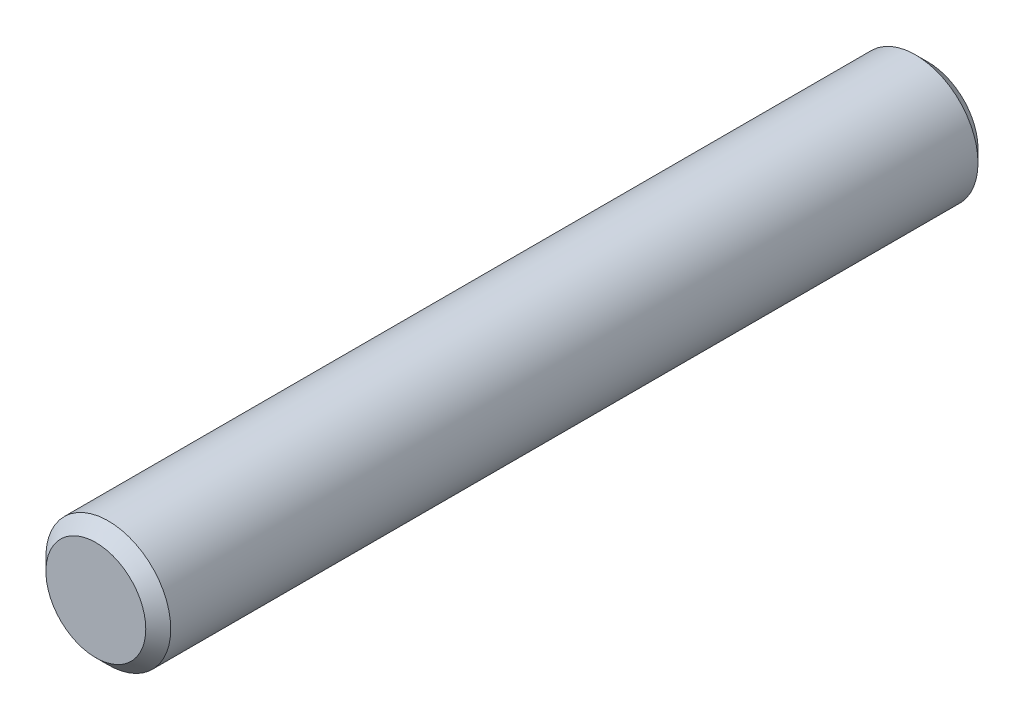
ISO-10303-21;
HEADER;
FILE_DESCRIPTION(('STEP AP214'),'2;1');
FILE_NAME('part.step','',(''),(''),'','','');
FILE_SCHEMA(('AUTOMOTIVE_DESIGN { 1 0 10303 214 1 1 1 1 }'));
ENDSEC;
DATA;
#1=APPLICATION_CONTEXT('core data for automotive mechanical design processes');
#2=APPLICATION_PROTOCOL_DEFINITION('international standard','automotive_design',2000,#1);
#3=PRODUCT_CONTEXT('',#1,'mechanical');
#4=PRODUCT('Part','Part','',(#3));
#5=PRODUCT_RELATED_PRODUCT_CATEGORY('part','',(#4));
#6=PRODUCT_DEFINITION_FORMATION('','',#4);
#7=PRODUCT_DEFINITION_CONTEXT('part definition',#1,'design');
#8=PRODUCT_DEFINITION('design','',#6,#7);
#9=PRODUCT_DEFINITION_SHAPE('','',#8);
#10=(LENGTH_UNIT() NAMED_UNIT(*) SI_UNIT(.MILLI.,.METRE.));
#11=(NAMED_UNIT(*) PLANE_ANGLE_UNIT() SI_UNIT($,.RADIAN.));
#12=(NAMED_UNIT(*) SI_UNIT($,.STERADIAN.) SOLID_ANGLE_UNIT());
#13=UNCERTAINTY_MEASURE_WITH_UNIT(LENGTH_MEASURE(1.E-05),#10,'distance_accuracy_value','');
#14=(GEOMETRIC_REPRESENTATION_CONTEXT(3) GLOBAL_UNCERTAINTY_ASSIGNED_CONTEXT((#13)) GLOBAL_UNIT_ASSIGNED_CONTEXT((#10,
#11,#12)) REPRESENTATION_CONTEXT('',''));
#15=CARTESIAN_POINT('',(0.,0.,0.));
#16=DIRECTION('',(0.,0.,1.));
#17=DIRECTION('',(1.,0.,0.));
#18=AXIS2_PLACEMENT_3D('',#15,#16,#17);
#19=CARTESIAN_POINT('',(0.,0.,10.));
#20=DIRECTION('',(0.,0.,-1.));
#21=DIRECTION('',(-1.,0.,0.));
#22=AXIS2_PLACEMENT_3D('',#19,#20,#21);
#23=CYLINDRICAL_SURFACE('',#22,1.5);
#24=CARTESIAN_POINT('',(0.,0.,-9.7));
#25=DIRECTION('',(0.,0.,1.));
#26=DIRECTION('',(1.,0.,0.));
#27=AXIS2_PLACEMENT_3D('',#24,#25,#26);
#28=CIRCLE('',#27,1.5);
#29=CARTESIAN_POINT('',(1.5,0.,-9.7));
#30=VERTEX_POINT('',#29);
#31=EDGE_CURVE('E27',#30,#30,#28,.T.);
#32=ORIENTED_EDGE('',*,*,#31,.T.);
#33=EDGE_LOOP('',(#32));
#34=FACE_BOUND('',#33,.T.);
#35=CARTESIAN_POINT('',(0.,0.,9.7));
#36=DIRECTION('',(0.,0.,1.));
#37=DIRECTION('',(1.,0.,0.));
#38=AXIS2_PLACEMENT_3D('',#35,#36,#37);
#39=CIRCLE('',#38,1.5);
#40=CARTESIAN_POINT('',(1.5,0.,9.7));
#41=VERTEX_POINT('',#40);
#42=EDGE_CURVE('E31',#41,#41,#39,.F.);
#43=ORIENTED_EDGE('',*,*,#42,.T.);
#44=EDGE_LOOP('',(#43));
#45=FACE_BOUND('',#44,.T.);
#46=ADVANCED_FACE('F15',(#34,#45),#23,.T.);
#47=CARTESIAN_POINT('',(0.,0.,10.));
#48=DIRECTION('',(0.,0.,1.));
#49=DIRECTION('',(1.,0.,0.));
#50=AXIS2_PLACEMENT_3D('',#47,#48,#49);
#51=PLANE('',#50);
#52=CARTESIAN_POINT('',(0.,0.,10.));
#53=DIRECTION('',(0.,0.,1.));
#54=DIRECTION('',(1.,0.,0.));
#55=AXIS2_PLACEMENT_3D('',#52,#53,#54);
#56=CIRCLE('',#55,1.2);
#57=CARTESIAN_POINT('',(1.2,0.,10.));
#58=VERTEX_POINT('',#57);
#59=EDGE_CURVE('E10',#58,#58,#56,.T.);
#60=ORIENTED_EDGE('',*,*,#59,.T.);
#61=EDGE_LOOP('',(#60));
#62=FACE_BOUND('',#61,.T.);
#63=ADVANCED_FACE('F48',(#62),#51,.T.);
#64=CARTESIAN_POINT('',(0.,0.,-10.));
#65=DIRECTION('',(0.,0.,1.));
#66=DIRECTION('',(1.,0.,0.));
#67=AXIS2_PLACEMENT_3D('',#64,#65,#66);
#68=PLANE('',#67);
#69=CARTESIAN_POINT('',(0.,0.,-10.));
#70=DIRECTION('',(0.,0.,1.));
#71=DIRECTION('',(1.,0.,0.));
#72=AXIS2_PLACEMENT_3D('',#69,#70,#71);
#73=CIRCLE('',#72,1.2);
#74=CARTESIAN_POINT('',(1.2,0.,-10.));
#75=VERTEX_POINT('',#74);
#76=EDGE_CURVE('E23',#75,#75,#73,.F.);
#77=ORIENTED_EDGE('',*,*,#76,.T.);
#78=EDGE_LOOP('',(#77));
#79=FACE_BOUND('',#78,.T.);
#80=ADVANCED_FACE('F45',(#79),#68,.F.);
#81=CARTESIAN_POINT('',(0.,0.,-9.7));
#82=DIRECTION('',(0.,0.,1.));
#83=DIRECTION('',(1.,0.,0.));
#84=AXIS2_PLACEMENT_3D('',#81,#82,#83);
#85=CONICAL_SURFACE('',#84,1.5,0.785398163397452);
#86=ORIENTED_EDGE('',*,*,#76,.F.);
#87=EDGE_LOOP('',(#86));
#88=FACE_BOUND('',#87,.T.);
#89=ORIENTED_EDGE('',*,*,#31,.F.);
#90=EDGE_LOOP('',(#89));
#91=FACE_BOUND('',#90,.T.);
#92=ADVANCED_FACE('F40',(#88,#91),#85,.T.);
#93=CARTESIAN_POINT('',(0.,0.,10.));
#94=DIRECTION('',(0.,0.,-1.));
#95=DIRECTION('',(-1.,0.,0.));
#96=AXIS2_PLACEMENT_3D('',#93,#94,#95);
#97=CONICAL_SURFACE('',#96,1.2,0.785398163397446);
#98=ORIENTED_EDGE('',*,*,#42,.F.);
#99=EDGE_LOOP('',(#98));
#100=FACE_BOUND('',#99,.T.);
#101=ORIENTED_EDGE('',*,*,#59,.F.);
#102=EDGE_LOOP('',(#101));
#103=FACE_BOUND('',#102,.T.);
#104=ADVANCED_FACE('F18',(#100,#103),#97,.T.);
#105=CLOSED_SHELL('',(#46,#63,#80,#92,#104));
#106=MANIFOLD_SOLID_BREP('B1',#105);
#107=ADVANCED_BREP_SHAPE_REPRESENTATION('',(#18,#106),#14);
#108=SHAPE_DEFINITION_REPRESENTATION(#9,#107);
ENDSEC;
END-ISO-10303-21;
